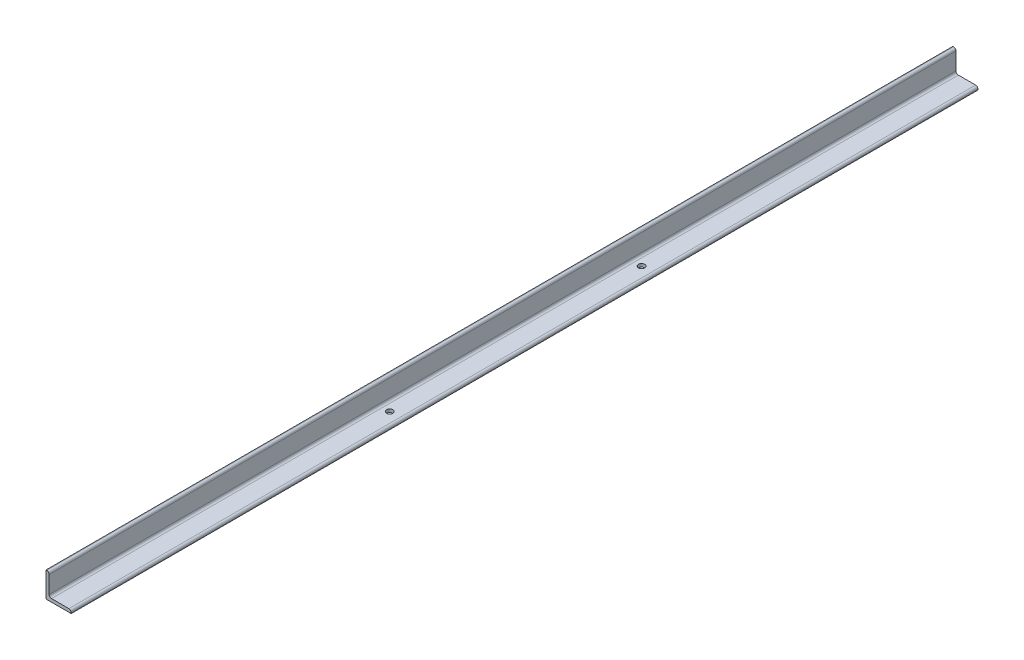
ISO-10303-21;
HEADER;
FILE_DESCRIPTION(('STEP AP214'),'2;1');
FILE_NAME('part.step','',(''),(''),'','','');
FILE_SCHEMA(('AUTOMOTIVE_DESIGN { 1 0 10303 214 1 1 1 1 }'));
ENDSEC;
DATA;
#1=APPLICATION_CONTEXT('core data for automotive mechanical design processes');
#2=APPLICATION_PROTOCOL_DEFINITION('international standard','automotive_design',2000,#1);
#3=PRODUCT_CONTEXT('',#1,'mechanical');
#4=PRODUCT('Part','Part','',(#3));
#5=PRODUCT_RELATED_PRODUCT_CATEGORY('part','',(#4));
#6=PRODUCT_DEFINITION_FORMATION('','',#4);
#7=PRODUCT_DEFINITION_CONTEXT('part definition',#1,'design');
#8=PRODUCT_DEFINITION('design','',#6,#7);
#9=PRODUCT_DEFINITION_SHAPE('','',#8);
#10=(LENGTH_UNIT() NAMED_UNIT(*) SI_UNIT(.MILLI.,.METRE.));
#11=(NAMED_UNIT(*) PLANE_ANGLE_UNIT() SI_UNIT($,.RADIAN.));
#12=(NAMED_UNIT(*) SI_UNIT($,.STERADIAN.) SOLID_ANGLE_UNIT());
#13=UNCERTAINTY_MEASURE_WITH_UNIT(LENGTH_MEASURE(1.E-05),#10,'distance_accuracy_value','');
#14=(GEOMETRIC_REPRESENTATION_CONTEXT(3) GLOBAL_UNCERTAINTY_ASSIGNED_CONTEXT((#13)) GLOBAL_UNIT_ASSIGNED_CONTEXT((#10,
#11,#12)) REPRESENTATION_CONTEXT('',''));
#15=CARTESIAN_POINT('',(0.,0.,0.));
#16=DIRECTION('',(0.,0.,1.));
#17=DIRECTION('',(1.,0.,0.));
#18=AXIS2_PLACEMENT_3D('',#15,#16,#17);
#19=CARTESIAN_POINT('',(50.7999999999999,0.,914.4));
#20=DIRECTION('',(0.,1.,0.));
#21=DIRECTION('',(0.,0.,1.));
#22=AXIS2_PLACEMENT_3D('',#19,#20,#21);
#23=PLANE('',#22);
#24=CARTESIAN_POINT('',(25.4,0.,246.634));
#25=DIRECTION('',(0.,-1.,0.));
#26=DIRECTION('',(0.,0.,-1.));
#27=AXIS2_PLACEMENT_3D('',#24,#25,#26);
#28=CIRCLE('',#27,6.35);
#29=CARTESIAN_POINT('',(25.4,0.,240.284));
#30=VERTEX_POINT('',#29);
#31=EDGE_CURVE('E203',#30,#30,#28,.T.);
#32=ORIENTED_EDGE('',*,*,#31,.F.);
#33=EDGE_LOOP('',(#32));
#34=FACE_BOUND('',#33,.T.);
#35=CARTESIAN_POINT('',(25.4,0.,-261.366));
#36=DIRECTION('',(0.,-1.,0.));
#37=DIRECTION('',(0.,0.,-1.));
#38=AXIS2_PLACEMENT_3D('',#35,#36,#37);
#39=CIRCLE('',#38,6.35);
#40=CARTESIAN_POINT('',(25.4,0.,-267.716));
#41=VERTEX_POINT('',#40);
#42=EDGE_CURVE('E197',#41,#41,#39,.T.);
#43=ORIENTED_EDGE('',*,*,#42,.F.);
#44=EDGE_LOOP('',(#43));
#45=FACE_BOUND('',#44,.T.);
#46=DIRECTION('',(1.,0.,0.));
#47=VECTOR('',#46,1.);
#48=CARTESIAN_POINT('',(50.7999999999999,0.,-914.4));
#49=LINE('',#48,#47);
#50=CARTESIAN_POINT('',(0.,0.,-914.4));
#51=VERTEX_POINT('',#50);
#52=CARTESIAN_POINT('',(50.7999999999999,0.,-914.4));
#53=VERTEX_POINT('',#52);
#54=EDGE_CURVE('E137',#51,#53,#49,.T.);
#55=ORIENTED_EDGE('',*,*,#54,.T.);
#56=DIRECTION('',(0.,0.,-1.));
#57=VECTOR('',#56,1.);
#58=CARTESIAN_POINT('',(50.7999999999999,0.,914.4));
#59=LINE('',#58,#57);
#60=CARTESIAN_POINT('',(50.7999999999999,0.,914.4));
#61=VERTEX_POINT('',#60);
#62=EDGE_CURVE('E11',#61,#53,#59,.T.);
#63=ORIENTED_EDGE('',*,*,#62,.F.);
#64=DIRECTION('',(1.,0.,0.));
#65=VECTOR('',#64,1.);
#66=CARTESIAN_POINT('',(50.7999999999999,0.,914.4));
#67=LINE('',#66,#65);
#68=CARTESIAN_POINT('',(0.,0.,914.4));
#69=VERTEX_POINT('',#68);
#70=EDGE_CURVE('E154',#69,#61,#67,.T.);
#71=ORIENTED_EDGE('',*,*,#70,.F.);
#72=DIRECTION('',(0.,0.,-1.));
#73=VECTOR('',#72,1.);
#74=CARTESIAN_POINT('',(0.,0.,914.4));
#75=LINE('',#74,#73);
#76=EDGE_CURVE('E133',#69,#51,#75,.T.);
#77=ORIENTED_EDGE('',*,*,#76,.T.);
#78=EDGE_LOOP('',(#55,#63,#71,#77));
#79=FACE_BOUND('',#78,.T.);
#80=ADVANCED_FACE('F35',(#34,#45,#79),#23,.F.);
#81=CARTESIAN_POINT('',(50.7999999999999,1.59258,914.4));
#82=DIRECTION('',(-1.,0.,0.));
#83=DIRECTION('',(0.,0.,1.));
#84=AXIS2_PLACEMENT_3D('',#81,#82,#83);
#85=PLANE('',#84);
#86=DIRECTION('',(0.,1.,0.));
#87=VECTOR('',#86,1.);
#88=CARTESIAN_POINT('',(50.7999999999999,1.59258,-914.4));
#89=LINE('',#88,#87);
#90=CARTESIAN_POINT('',(50.7999999999999,1.59258,-914.4));
#91=VERTEX_POINT('',#90);
#92=EDGE_CURVE('E140',#53,#91,#89,.T.);
#93=ORIENTED_EDGE('',*,*,#92,.T.);
#94=DIRECTION('',(0.,0.,-1.));
#95=VECTOR('',#94,1.);
#96=CARTESIAN_POINT('',(50.7999999999999,1.59258,914.4));
#97=LINE('',#96,#95);
#98=CARTESIAN_POINT('',(50.7999999999999,1.59258,914.4));
#99=VERTEX_POINT('',#98);
#100=EDGE_CURVE('E43',#99,#91,#97,.T.);
#101=ORIENTED_EDGE('',*,*,#100,.F.);
#102=DIRECTION('',(0.,1.,0.));
#103=VECTOR('',#102,1.);
#104=CARTESIAN_POINT('',(50.7999999999999,1.59258,914.4));
#105=LINE('',#104,#103);
#106=EDGE_CURVE('E97',#61,#99,#105,.T.);
#107=ORIENTED_EDGE('',*,*,#106,.F.);
#108=ORIENTED_EDGE('',*,*,#62,.T.);
#109=EDGE_LOOP('',(#93,#101,#107,#108));
#110=FACE_BOUND('',#109,.T.);
#111=ADVANCED_FACE('F212',(#110),#85,.F.);
#112=CARTESIAN_POINT('',(46.0425799999999,1.59258,914.4));
#113=DIRECTION('',(0.,0.,-1.));
#114=DIRECTION('',(-1.,0.,0.));
#115=AXIS2_PLACEMENT_3D('',#112,#113,#114);
#116=CYLINDRICAL_SURFACE('',#115,4.75742);
#117=CARTESIAN_POINT('',(46.0425799999999,1.59258,-914.4));
#118=DIRECTION('',(0.,0.,1.));
#119=DIRECTION('',(1.,0.,0.));
#120=AXIS2_PLACEMENT_3D('',#117,#118,#119);
#121=CIRCLE('',#120,4.75742);
#122=CARTESIAN_POINT('',(46.0425799999999,6.34999999999999,-914.4));
#123=VERTEX_POINT('',#122);
#124=EDGE_CURVE('E143',#91,#123,#121,.T.);
#125=ORIENTED_EDGE('',*,*,#124,.T.);
#126=DIRECTION('',(0.,0.,-1.));
#127=VECTOR('',#126,1.);
#128=CARTESIAN_POINT('',(46.0425799999999,6.34999999999999,914.4));
#129=LINE('',#128,#127);
#130=CARTESIAN_POINT('',(46.0425799999999,6.34999999999999,914.4));
#131=VERTEX_POINT('',#130);
#132=EDGE_CURVE('E164',#131,#123,#129,.T.);
#133=ORIENTED_EDGE('',*,*,#132,.F.);
#134=CARTESIAN_POINT('',(46.0425799999999,1.59258,914.4));
#135=DIRECTION('',(0.,0.,1.));
#136=DIRECTION('',(1.,0.,0.));
#137=AXIS2_PLACEMENT_3D('',#134,#135,#136);
#138=CIRCLE('',#137,4.75742);
#139=EDGE_CURVE('E172',#99,#131,#138,.T.);
#140=ORIENTED_EDGE('',*,*,#139,.F.);
#141=ORIENTED_EDGE('',*,*,#100,.T.);
#142=EDGE_LOOP('',(#125,#133,#140,#141));
#143=FACE_BOUND('',#142,.T.);
#144=ADVANCED_FACE('F170',(#143),#116,.T.);
#145=CARTESIAN_POINT('',(11.1125,6.34999999999999,914.4));
#146=DIRECTION('',(0.,-1.,0.));
#147=DIRECTION('',(0.,0.,-1.));
#148=AXIS2_PLACEMENT_3D('',#145,#146,#147);
#149=PLANE('',#148);
#150=CARTESIAN_POINT('',(25.4,6.34999999999999,246.634));
#151=DIRECTION('',(0.,-1.,0.));
#152=DIRECTION('',(0.,0.,-1.));
#153=AXIS2_PLACEMENT_3D('',#150,#151,#152);
#154=CIRCLE('',#153,6.35);
#155=CARTESIAN_POINT('',(25.4,6.34999999999999,240.284));
#156=VERTEX_POINT('',#155);
#157=EDGE_CURVE('E200',#156,#156,#154,.F.);
#158=ORIENTED_EDGE('',*,*,#157,.F.);
#159=EDGE_LOOP('',(#158));
#160=FACE_BOUND('',#159,.T.);
#161=CARTESIAN_POINT('',(25.4,6.34999999999999,-261.366));
#162=DIRECTION('',(0.,-1.,0.));
#163=DIRECTION('',(0.,0.,-1.));
#164=AXIS2_PLACEMENT_3D('',#161,#162,#163);
#165=CIRCLE('',#164,6.35);
#166=CARTESIAN_POINT('',(25.4,6.34999999999999,-267.716));
#167=VERTEX_POINT('',#166);
#168=EDGE_CURVE('E141',#167,#167,#165,.F.);
#169=ORIENTED_EDGE('',*,*,#168,.F.);
#170=EDGE_LOOP('',(#169));
#171=FACE_BOUND('',#170,.T.);
#172=DIRECTION('',(-1.,0.,0.));
#173=VECTOR('',#172,1.);
#174=CARTESIAN_POINT('',(11.1125,6.34999999999999,-914.4));
#175=LINE('',#174,#173);
#176=CARTESIAN_POINT('',(11.1125,6.34999999999999,-914.4));
#177=VERTEX_POINT('',#176);
#178=EDGE_CURVE('E145',#123,#177,#175,.T.);
#179=ORIENTED_EDGE('',*,*,#178,.T.);
#180=DIRECTION('',(0.,0.,-1.));
#181=VECTOR('',#180,1.);
#182=CARTESIAN_POINT('',(11.1125,6.34999999999999,914.4));
#183=LINE('',#182,#181);
#184=CARTESIAN_POINT('',(11.1125,6.34999999999999,914.4));
#185=VERTEX_POINT('',#184);
#186=EDGE_CURVE('E161',#185,#177,#183,.T.);
#187=ORIENTED_EDGE('',*,*,#186,.F.);
#188=DIRECTION('',(-1.,0.,0.));
#189=VECTOR('',#188,1.);
#190=CARTESIAN_POINT('',(11.1125,6.34999999999999,914.4));
#191=LINE('',#190,#189);
#192=EDGE_CURVE('E188',#131,#185,#191,.T.);
#193=ORIENTED_EDGE('',*,*,#192,.F.);
#194=ORIENTED_EDGE('',*,*,#132,.T.);
#195=EDGE_LOOP('',(#179,#187,#193,#194));
#196=FACE_BOUND('',#195,.T.);
#197=ADVANCED_FACE('F181',(#160,#171,#196),#149,.F.);
#198=CARTESIAN_POINT('',(11.1125,11.1125,914.4));
#199=DIRECTION('',(0.,0.,-1.));
#200=DIRECTION('',(-1.,0.,0.));
#201=AXIS2_PLACEMENT_3D('',#198,#199,#200);
#202=CYLINDRICAL_SURFACE('',#201,4.7625);
#203=CARTESIAN_POINT('',(11.1125,11.1125,-914.4));
#204=DIRECTION('',(0.,0.,-1.));
#205=DIRECTION('',(-1.,0.,0.));
#206=AXIS2_PLACEMENT_3D('',#203,#204,#205);
#207=CIRCLE('',#206,4.7625);
#208=CARTESIAN_POINT('',(6.35,11.1125,-914.4));
#209=VERTEX_POINT('',#208);
#210=EDGE_CURVE('E147',#177,#209,#207,.T.);
#211=ORIENTED_EDGE('',*,*,#210,.T.);
#212=DIRECTION('',(0.,0.,-1.));
#213=VECTOR('',#212,1.);
#214=CARTESIAN_POINT('',(6.35,11.1125,914.4));
#215=LINE('',#214,#213);
#216=CARTESIAN_POINT('',(6.35,11.1125,914.4));
#217=VERTEX_POINT('',#216);
#218=EDGE_CURVE('E158',#217,#209,#215,.T.);
#219=ORIENTED_EDGE('',*,*,#218,.F.);
#220=CARTESIAN_POINT('',(11.1125,11.1125,914.4));
#221=DIRECTION('',(0.,0.,-1.));
#222=DIRECTION('',(-1.,0.,0.));
#223=AXIS2_PLACEMENT_3D('',#220,#221,#222);
#224=CIRCLE('',#223,4.7625);
#225=EDGE_CURVE('E187',#185,#217,#224,.T.);
#226=ORIENTED_EDGE('',*,*,#225,.F.);
#227=ORIENTED_EDGE('',*,*,#186,.T.);
#228=EDGE_LOOP('',(#211,#219,#226,#227));
#229=FACE_BOUND('',#228,.T.);
#230=ADVANCED_FACE('F185',(#229),#202,.F.);
#231=CARTESIAN_POINT('',(6.35,46.04258,914.4));
#232=DIRECTION('',(-1.,0.,0.));
#233=DIRECTION('',(0.,-1.,0.));
#234=AXIS2_PLACEMENT_3D('',#231,#232,#233);
#235=PLANE('',#234);
#236=DIRECTION('',(0.,1.,0.));
#237=VECTOR('',#236,1.);
#238=CARTESIAN_POINT('',(6.35,46.04258,-914.4));
#239=LINE('',#238,#237);
#240=CARTESIAN_POINT('',(6.35,46.04258,-914.4));
#241=VERTEX_POINT('',#240);
#242=EDGE_CURVE('E149',#209,#241,#239,.T.);
#243=ORIENTED_EDGE('',*,*,#242,.T.);
#244=DIRECTION('',(0.,0.,-1.));
#245=VECTOR('',#244,1.);
#246=CARTESIAN_POINT('',(6.35,46.04258,914.4));
#247=LINE('',#246,#245);
#248=CARTESIAN_POINT('',(6.35,46.04258,914.4));
#249=VERTEX_POINT('',#248);
#250=EDGE_CURVE('E128',#249,#241,#247,.T.);
#251=ORIENTED_EDGE('',*,*,#250,.F.);
#252=DIRECTION('',(0.,1.,0.));
#253=VECTOR('',#252,1.);
#254=CARTESIAN_POINT('',(6.35,46.04258,914.4));
#255=LINE('',#254,#253);
#256=EDGE_CURVE('E119',#217,#249,#255,.T.);
#257=ORIENTED_EDGE('',*,*,#256,.F.);
#258=ORIENTED_EDGE('',*,*,#218,.T.);
#259=EDGE_LOOP('',(#243,#251,#257,#258));
#260=FACE_BOUND('',#259,.T.);
#261=ADVANCED_FACE('F218',(#260),#235,.F.);
#262=CARTESIAN_POINT('',(1.59258,46.04258,914.4));
#263=DIRECTION('',(0.,0.,-1.));
#264=DIRECTION('',(-1.,0.,0.));
#265=AXIS2_PLACEMENT_3D('',#262,#263,#264);
#266=CYLINDRICAL_SURFACE('',#265,4.75742);
#267=CARTESIAN_POINT('',(1.59258,46.04258,-914.4));
#268=DIRECTION('',(0.,0.,1.));
#269=DIRECTION('',(-1.,0.,0.));
#270=AXIS2_PLACEMENT_3D('',#267,#268,#269);
#271=CIRCLE('',#270,4.75742);
#272=CARTESIAN_POINT('',(1.59258,50.8,-914.4));
#273=VERTEX_POINT('',#272);
#274=EDGE_CURVE('E127',#241,#273,#271,.T.);
#275=ORIENTED_EDGE('',*,*,#274,.T.);
#276=DIRECTION('',(0.,0.,-1.));
#277=VECTOR('',#276,1.);
#278=CARTESIAN_POINT('',(1.59258,50.8,914.4));
#279=LINE('',#278,#277);
#280=CARTESIAN_POINT('',(1.59258,50.8,914.4));
#281=VERTEX_POINT('',#280);
#282=EDGE_CURVE('E124',#281,#273,#279,.T.);
#283=ORIENTED_EDGE('',*,*,#282,.F.);
#284=CARTESIAN_POINT('',(1.59258,46.04258,914.4));
#285=DIRECTION('',(0.,0.,1.));
#286=DIRECTION('',(-1.,0.,0.));
#287=AXIS2_PLACEMENT_3D('',#284,#285,#286);
#288=CIRCLE('',#287,4.75742);
#289=EDGE_CURVE('E113',#249,#281,#288,.T.);
#290=ORIENTED_EDGE('',*,*,#289,.F.);
#291=ORIENTED_EDGE('',*,*,#250,.T.);
#292=EDGE_LOOP('',(#275,#283,#290,#291));
#293=FACE_BOUND('',#292,.T.);
#294=ADVANCED_FACE('F125',(#293),#266,.T.);
#295=CARTESIAN_POINT('',(0.,50.8,914.4));
#296=DIRECTION('',(0.,-1.,0.));
#297=DIRECTION('',(0.,0.,-1.));
#298=AXIS2_PLACEMENT_3D('',#295,#296,#297);
#299=PLANE('',#298);
#300=DIRECTION('',(-1.,0.,0.));
#301=VECTOR('',#300,1.);
#302=CARTESIAN_POINT('',(0.,50.8,-914.4));
#303=LINE('',#302,#301);
#304=CARTESIAN_POINT('',(0.,50.8,-914.4));
#305=VERTEX_POINT('',#304);
#306=EDGE_CURVE('E83',#273,#305,#303,.T.);
#307=ORIENTED_EDGE('',*,*,#306,.T.);
#308=DIRECTION('',(0.,0.,-1.));
#309=VECTOR('',#308,1.);
#310=CARTESIAN_POINT('',(0.,50.8,914.4));
#311=LINE('',#310,#309);
#312=CARTESIAN_POINT('',(0.,50.8,914.4));
#313=VERTEX_POINT('',#312);
#314=EDGE_CURVE('E129',#313,#305,#311,.T.);
#315=ORIENTED_EDGE('',*,*,#314,.F.);
#316=DIRECTION('',(-1.,0.,0.));
#317=VECTOR('',#316,1.);
#318=CARTESIAN_POINT('',(0.,50.8,914.4));
#319=LINE('',#318,#317);
#320=EDGE_CURVE('E117',#281,#313,#319,.T.);
#321=ORIENTED_EDGE('',*,*,#320,.F.);
#322=ORIENTED_EDGE('',*,*,#282,.T.);
#323=EDGE_LOOP('',(#307,#315,#321,#322));
#324=FACE_BOUND('',#323,.T.);
#325=ADVANCED_FACE('F131',(#324),#299,.F.);
#326=CARTESIAN_POINT('',(0.,0.,914.4));
#327=DIRECTION('',(1.,0.,0.));
#328=DIRECTION('',(0.,1.,0.));
#329=AXIS2_PLACEMENT_3D('',#326,#327,#328);
#330=PLANE('',#329);
#331=DIRECTION('',(0.,-1.,0.));
#332=VECTOR('',#331,1.);
#333=CARTESIAN_POINT('',(0.,0.,-914.4));
#334=LINE('',#333,#332);
#335=EDGE_CURVE('E89',#305,#51,#334,.T.);
#336=ORIENTED_EDGE('',*,*,#335,.T.);
#337=ORIENTED_EDGE('',*,*,#76,.F.);
#338=DIRECTION('',(0.,-1.,0.));
#339=VECTOR('',#338,1.);
#340=CARTESIAN_POINT('',(0.,0.,914.4));
#341=LINE('',#340,#339);
#342=EDGE_CURVE('E51',#313,#69,#341,.T.);
#343=ORIENTED_EDGE('',*,*,#342,.F.);
#344=ORIENTED_EDGE('',*,*,#314,.T.);
#345=EDGE_LOOP('',(#336,#337,#343,#344));
#346=FACE_BOUND('',#345,.T.);
#347=ADVANCED_FACE('F270',(#346),#330,.F.);
#348=CARTESIAN_POINT('',(1.59258,46.04258,914.4));
#349=DIRECTION('',(0.,0.,-1.));
#350=DIRECTION('',(-1.,0.,0.));
#351=AXIS2_PLACEMENT_3D('',#348,#349,#350);
#352=PLANE('',#351);
#353=ORIENTED_EDGE('',*,*,#70,.T.);
#354=ORIENTED_EDGE('',*,*,#106,.T.);
#355=ORIENTED_EDGE('',*,*,#139,.T.);
#356=ORIENTED_EDGE('',*,*,#192,.T.);
#357=ORIENTED_EDGE('',*,*,#225,.T.);
#358=ORIENTED_EDGE('',*,*,#256,.T.);
#359=ORIENTED_EDGE('',*,*,#289,.T.);
#360=ORIENTED_EDGE('',*,*,#320,.T.);
#361=ORIENTED_EDGE('',*,*,#342,.T.);
#362=EDGE_LOOP('',(#353,#354,#355,#356,#357,#358,#359,#360,#361));
#363=FACE_BOUND('',#362,.T.);
#364=ADVANCED_FACE('F115',(#363),#352,.F.);
#365=CARTESIAN_POINT('',(1.59258,46.04258,-914.4));
#366=DIRECTION('',(0.,0.,-1.));
#367=DIRECTION('',(-1.,0.,0.));
#368=AXIS2_PLACEMENT_3D('',#365,#366,#367);
#369=PLANE('',#368);
#370=ORIENTED_EDGE('',*,*,#54,.F.);
#371=ORIENTED_EDGE('',*,*,#335,.F.);
#372=ORIENTED_EDGE('',*,*,#306,.F.);
#373=ORIENTED_EDGE('',*,*,#274,.F.);
#374=ORIENTED_EDGE('',*,*,#242,.F.);
#375=ORIENTED_EDGE('',*,*,#210,.F.);
#376=ORIENTED_EDGE('',*,*,#178,.F.);
#377=ORIENTED_EDGE('',*,*,#124,.F.);
#378=ORIENTED_EDGE('',*,*,#92,.F.);
#379=EDGE_LOOP('',(#370,#371,#372,#373,#374,#375,#376,#377,#378));
#380=FACE_BOUND('',#379,.T.);
#381=ADVANCED_FACE('F176',(#380),#369,.T.);
#382=CARTESIAN_POINT('',(25.4,50.801,-261.366));
#383=DIRECTION('',(0.,-1.,0.));
#384=DIRECTION('',(0.,0.,-1.));
#385=AXIS2_PLACEMENT_3D('',#382,#383,#384);
#386=CYLINDRICAL_SURFACE('',#385,6.35);
#387=ORIENTED_EDGE('',*,*,#42,.T.);
#388=EDGE_LOOP('',(#387));
#389=FACE_BOUND('',#388,.T.);
#390=ORIENTED_EDGE('',*,*,#168,.T.);
#391=EDGE_LOOP('',(#390));
#392=FACE_BOUND('',#391,.T.);
#393=ADVANCED_FACE('F293',(#389,#392),#386,.F.);
#394=CARTESIAN_POINT('',(25.4,50.801,246.634));
#395=DIRECTION('',(0.,-1.,0.));
#396=DIRECTION('',(0.,0.,-1.));
#397=AXIS2_PLACEMENT_3D('',#394,#395,#396);
#398=CYLINDRICAL_SURFACE('',#397,6.35);
#399=ORIENTED_EDGE('',*,*,#31,.T.);
#400=EDGE_LOOP('',(#399));
#401=FACE_BOUND('',#400,.T.);
#402=ORIENTED_EDGE('',*,*,#157,.T.);
#403=EDGE_LOOP('',(#402));
#404=FACE_BOUND('',#403,.T.);
#405=ADVANCED_FACE('F207',(#401,#404),#398,.F.);
#406=CLOSED_SHELL('',(#80,#111,#144,#197,#230,#261,#294,#325,#347,#364,#381,#393,#405));
#407=MANIFOLD_SOLID_BREP('B2',#406);
#408=ADVANCED_BREP_SHAPE_REPRESENTATION('',(#18,#407),#14);
#409=SHAPE_DEFINITION_REPRESENTATION(#9,#408);
ENDSEC;
END-ISO-10303-21;
